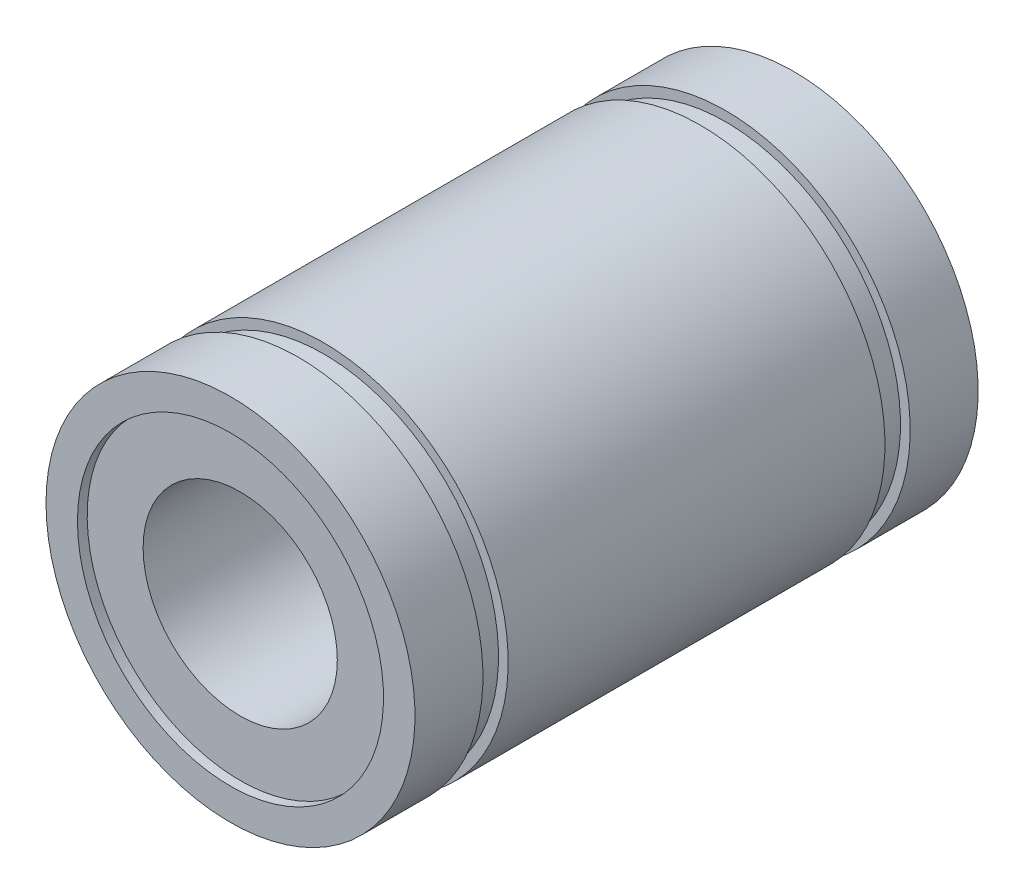
ISO-10303-21;
HEADER;
FILE_DESCRIPTION(('STEP AP214'),'2;1');
FILE_NAME('part.step','',(''),(''),'','','');
FILE_SCHEMA(('AUTOMOTIVE_DESIGN { 1 0 10303 214 1 1 1 1 }'));
ENDSEC;
DATA;
#1=APPLICATION_CONTEXT('core data for automotive mechanical design processes');
#2=APPLICATION_PROTOCOL_DEFINITION('international standard','automotive_design',2000,#1);
#3=PRODUCT_CONTEXT('',#1,'mechanical');
#4=PRODUCT('Part','Part','',(#3));
#5=PRODUCT_RELATED_PRODUCT_CATEGORY('part','',(#4));
#6=PRODUCT_DEFINITION_FORMATION('','',#4);
#7=PRODUCT_DEFINITION_CONTEXT('part definition',#1,'design');
#8=PRODUCT_DEFINITION('design','',#6,#7);
#9=PRODUCT_DEFINITION_SHAPE('','',#8);
#10=(LENGTH_UNIT() NAMED_UNIT(*) SI_UNIT(.MILLI.,.METRE.));
#11=(NAMED_UNIT(*) PLANE_ANGLE_UNIT() SI_UNIT($,.RADIAN.));
#12=(NAMED_UNIT(*) SI_UNIT($,.STERADIAN.) SOLID_ANGLE_UNIT());
#13=UNCERTAINTY_MEASURE_WITH_UNIT(LENGTH_MEASURE(1.E-05),#10,'distance_accuracy_value','');
#14=(GEOMETRIC_REPRESENTATION_CONTEXT(3) GLOBAL_UNCERTAINTY_ASSIGNED_CONTEXT((#13)) GLOBAL_UNIT_ASSIGNED_CONTEXT((#10,
#11,#12)) REPRESENTATION_CONTEXT('',''));
#15=CARTESIAN_POINT('',(0.,0.,0.));
#16=DIRECTION('',(0.,0.,1.));
#17=DIRECTION('',(1.,0.,0.));
#18=AXIS2_PLACEMENT_3D('',#15,#16,#17);
#19=CARTESIAN_POINT('',(0.,0.,29.));
#20=DIRECTION('',(0.,0.,-1.));
#21=DIRECTION('',(-1.,0.,0.));
#22=AXIS2_PLACEMENT_3D('',#19,#20,#21);
#23=PLANE('',#22);
#24=CARTESIAN_POINT('',(0.,0.,29.));
#25=DIRECTION('',(0.,0.,-1.));
#26=DIRECTION('',(-1.,0.,0.));
#27=AXIS2_PLACEMENT_3D('',#24,#25,#26);
#28=CIRCLE('',#27,7.88);
#29=CARTESIAN_POINT('',(-7.88,0.,29.));
#30=VERTEX_POINT('',#29);
#31=EDGE_CURVE('E17',#30,#30,#28,.T.);
#32=ORIENTED_EDGE('',*,*,#31,.T.);
#33=EDGE_LOOP('',(#32));
#34=FACE_BOUND('',#33,.T.);
#35=CARTESIAN_POINT('',(0.,0.,29.));
#36=DIRECTION('',(0.,0.,-1.));
#37=DIRECTION('',(-1.,0.,0.));
#38=AXIS2_PLACEMENT_3D('',#35,#36,#37);
#39=CIRCLE('',#38,9.5);
#40=CARTESIAN_POINT('',(-9.5,0.,29.));
#41=VERTEX_POINT('',#40);
#42=EDGE_CURVE('E10',#41,#41,#39,.T.);
#43=ORIENTED_EDGE('',*,*,#42,.F.);
#44=EDGE_LOOP('',(#43));
#45=FACE_BOUND('',#44,.T.);
#46=ADVANCED_FACE('F14',(#34,#45),#23,.F.);
#47=CARTESIAN_POINT('',(0.,0.,0.));
#48=DIRECTION('',(0.,0.,-1.));
#49=DIRECTION('',(-1.,0.,0.));
#50=AXIS2_PLACEMENT_3D('',#47,#48,#49);
#51=CYLINDRICAL_SURFACE('',#50,9.5);
#52=ORIENTED_EDGE('',*,*,#42,.T.);
#53=EDGE_LOOP('',(#52));
#54=FACE_BOUND('',#53,.T.);
#55=CARTESIAN_POINT('',(0.,0.,25.5));
#56=DIRECTION('',(0.,0.,-1.));
#57=DIRECTION('',(-1.,0.,0.));
#58=AXIS2_PLACEMENT_3D('',#55,#56,#57);
#59=CIRCLE('',#58,9.5);
#60=CARTESIAN_POINT('',(-9.5,0.,25.5));
#61=VERTEX_POINT('',#60);
#62=EDGE_CURVE('E22',#61,#61,#59,.T.);
#63=ORIENTED_EDGE('',*,*,#62,.F.);
#64=EDGE_LOOP('',(#63));
#65=FACE_BOUND('',#64,.T.);
#66=ADVANCED_FACE('F98',(#54,#65),#51,.T.);
#67=CARTESIAN_POINT('',(0.,9.,25.5));
#68=DIRECTION('',(0.,0.,-1.));
#69=DIRECTION('',(-1.,0.,0.));
#70=AXIS2_PLACEMENT_3D('',#67,#68,#69);
#71=PLANE('',#70);
#72=ORIENTED_EDGE('',*,*,#62,.T.);
#73=EDGE_LOOP('',(#72));
#74=FACE_BOUND('',#73,.T.);
#75=CARTESIAN_POINT('',(0.,0.,25.5));
#76=DIRECTION('',(0.,0.,-1.));
#77=DIRECTION('',(-1.,0.,0.));
#78=AXIS2_PLACEMENT_3D('',#75,#76,#77);
#79=CIRCLE('',#78,9.);
#80=CARTESIAN_POINT('',(-9.,0.,25.5));
#81=VERTEX_POINT('',#80);
#82=EDGE_CURVE('E32',#81,#81,#79,.T.);
#83=ORIENTED_EDGE('',*,*,#82,.F.);
#84=EDGE_LOOP('',(#83));
#85=FACE_BOUND('',#84,.T.);
#86=ADVANCED_FACE('F96',(#74,#85),#71,.T.);
#87=CARTESIAN_POINT('',(0.,0.,0.));
#88=DIRECTION('',(0.,0.,-1.));
#89=DIRECTION('',(-1.,0.,0.));
#90=AXIS2_PLACEMENT_3D('',#87,#88,#89);
#91=CYLINDRICAL_SURFACE('',#90,9.);
#92=ORIENTED_EDGE('',*,*,#82,.T.);
#93=EDGE_LOOP('',(#92));
#94=FACE_BOUND('',#93,.T.);
#95=CARTESIAN_POINT('',(0.,0.,24.2));
#96=DIRECTION('',(0.,0.,-1.));
#97=DIRECTION('',(-1.,0.,0.));
#98=AXIS2_PLACEMENT_3D('',#95,#96,#97);
#99=CIRCLE('',#98,9.);
#100=CARTESIAN_POINT('',(-9.,0.,24.2));
#101=VERTEX_POINT('',#100);
#102=EDGE_CURVE('E83',#101,#101,#99,.T.);
#103=ORIENTED_EDGE('',*,*,#102,.F.);
#104=EDGE_LOOP('',(#103));
#105=FACE_BOUND('',#104,.T.);
#106=ADVANCED_FACE('F93',(#94,#105),#91,.T.);
#107=CARTESIAN_POINT('',(0.,9.5,24.2));
#108=DIRECTION('',(0.,0.,1.));
#109=DIRECTION('',(1.,0.,0.));
#110=AXIS2_PLACEMENT_3D('',#107,#108,#109);
#111=PLANE('',#110);
#112=ORIENTED_EDGE('',*,*,#102,.T.);
#113=EDGE_LOOP('',(#112));
#114=FACE_BOUND('',#113,.T.);
#115=CARTESIAN_POINT('',(0.,0.,24.2));
#116=DIRECTION('',(0.,0.,-1.));
#117=DIRECTION('',(-1.,0.,0.));
#118=AXIS2_PLACEMENT_3D('',#115,#116,#117);
#119=CIRCLE('',#118,9.5);
#120=CARTESIAN_POINT('',(-9.5,0.,24.2));
#121=VERTEX_POINT('',#120);
#122=EDGE_CURVE('E79',#121,#121,#119,.T.);
#123=ORIENTED_EDGE('',*,*,#122,.F.);
#124=EDGE_LOOP('',(#123));
#125=FACE_BOUND('',#124,.T.);
#126=ADVANCED_FACE('F107',(#114,#125),#111,.T.);
#127=CARTESIAN_POINT('',(0.,0.,0.));
#128=DIRECTION('',(0.,0.,-1.));
#129=DIRECTION('',(-1.,0.,0.));
#130=AXIS2_PLACEMENT_3D('',#127,#128,#129);
#131=CYLINDRICAL_SURFACE('',#130,9.5);
#132=ORIENTED_EDGE('',*,*,#122,.T.);
#133=EDGE_LOOP('',(#132));
#134=FACE_BOUND('',#133,.T.);
#135=CARTESIAN_POINT('',(0.,0.,4.8));
#136=DIRECTION('',(0.,0.,-1.));
#137=DIRECTION('',(-1.,0.,0.));
#138=AXIS2_PLACEMENT_3D('',#135,#136,#137);
#139=CIRCLE('',#138,9.5);
#140=CARTESIAN_POINT('',(-9.5,0.,4.8));
#141=VERTEX_POINT('',#140);
#142=EDGE_CURVE('E75',#141,#141,#139,.T.);
#143=ORIENTED_EDGE('',*,*,#142,.F.);
#144=EDGE_LOOP('',(#143));
#145=FACE_BOUND('',#144,.T.);
#146=ADVANCED_FACE('F156',(#134,#145),#131,.T.);
#147=CARTESIAN_POINT('',(0.,9.,4.8));
#148=DIRECTION('',(0.,0.,-1.));
#149=DIRECTION('',(-1.,0.,0.));
#150=AXIS2_PLACEMENT_3D('',#147,#148,#149);
#151=PLANE('',#150);
#152=ORIENTED_EDGE('',*,*,#142,.T.);
#153=EDGE_LOOP('',(#152));
#154=FACE_BOUND('',#153,.T.);
#155=CARTESIAN_POINT('',(0.,0.,4.8));
#156=DIRECTION('',(0.,0.,-1.));
#157=DIRECTION('',(-1.,0.,0.));
#158=AXIS2_PLACEMENT_3D('',#155,#156,#157);
#159=CIRCLE('',#158,9.);
#160=CARTESIAN_POINT('',(-9.,0.,4.8));
#161=VERTEX_POINT('',#160);
#162=EDGE_CURVE('E71',#161,#161,#159,.T.);
#163=ORIENTED_EDGE('',*,*,#162,.F.);
#164=EDGE_LOOP('',(#163));
#165=FACE_BOUND('',#164,.T.);
#166=ADVANCED_FACE('F152',(#154,#165),#151,.T.);
#167=CARTESIAN_POINT('',(0.,0.,0.));
#168=DIRECTION('',(0.,0.,-1.));
#169=DIRECTION('',(-1.,0.,0.));
#170=AXIS2_PLACEMENT_3D('',#167,#168,#169);
#171=CYLINDRICAL_SURFACE('',#170,9.);
#172=ORIENTED_EDGE('',*,*,#162,.T.);
#173=EDGE_LOOP('',(#172));
#174=FACE_BOUND('',#173,.T.);
#175=CARTESIAN_POINT('',(0.,0.,3.5));
#176=DIRECTION('',(0.,0.,-1.));
#177=DIRECTION('',(-1.,0.,0.));
#178=AXIS2_PLACEMENT_3D('',#175,#176,#177);
#179=CIRCLE('',#178,9.);
#180=CARTESIAN_POINT('',(-9.,0.,3.5));
#181=VERTEX_POINT('',#180);
#182=EDGE_CURVE('E67',#181,#181,#179,.T.);
#183=ORIENTED_EDGE('',*,*,#182,.F.);
#184=EDGE_LOOP('',(#183));
#185=FACE_BOUND('',#184,.T.);
#186=ADVANCED_FACE('F148',(#174,#185),#171,.T.);
#187=CARTESIAN_POINT('',(0.,9.5,3.5));
#188=DIRECTION('',(0.,0.,1.));
#189=DIRECTION('',(1.,0.,0.));
#190=AXIS2_PLACEMENT_3D('',#187,#188,#189);
#191=PLANE('',#190);
#192=ORIENTED_EDGE('',*,*,#182,.T.);
#193=EDGE_LOOP('',(#192));
#194=FACE_BOUND('',#193,.T.);
#195=CARTESIAN_POINT('',(0.,0.,3.5));
#196=DIRECTION('',(0.,0.,-1.));
#197=DIRECTION('',(-1.,0.,0.));
#198=AXIS2_PLACEMENT_3D('',#195,#196,#197);
#199=CIRCLE('',#198,9.5);
#200=CARTESIAN_POINT('',(-9.5,0.,3.5));
#201=VERTEX_POINT('',#200);
#202=EDGE_CURVE('E63',#201,#201,#199,.T.);
#203=ORIENTED_EDGE('',*,*,#202,.F.);
#204=EDGE_LOOP('',(#203));
#205=FACE_BOUND('',#204,.T.);
#206=ADVANCED_FACE('F144',(#194,#205),#191,.T.);
#207=CARTESIAN_POINT('',(0.,0.,0.));
#208=DIRECTION('',(0.,0.,-1.));
#209=DIRECTION('',(-1.,0.,0.));
#210=AXIS2_PLACEMENT_3D('',#207,#208,#209);
#211=CYLINDRICAL_SURFACE('',#210,9.5);
#212=ORIENTED_EDGE('',*,*,#202,.T.);
#213=EDGE_LOOP('',(#212));
#214=FACE_BOUND('',#213,.T.);
#215=CARTESIAN_POINT('',(0.,0.,0.));
#216=DIRECTION('',(0.,0.,-1.));
#217=DIRECTION('',(-1.,0.,0.));
#218=AXIS2_PLACEMENT_3D('',#215,#216,#217);
#219=CIRCLE('',#218,9.5);
#220=CARTESIAN_POINT('',(-9.5,0.,0.));
#221=VERTEX_POINT('',#220);
#222=EDGE_CURVE('E45',#221,#221,#219,.T.);
#223=ORIENTED_EDGE('',*,*,#222,.F.);
#224=EDGE_LOOP('',(#223));
#225=FACE_BOUND('',#224,.T.);
#226=ADVANCED_FACE('F129',(#214,#225),#211,.T.);
#227=CARTESIAN_POINT('',(0.,0.,0.));
#228=DIRECTION('',(0.,0.,-1.));
#229=DIRECTION('',(-1.,0.,0.));
#230=AXIS2_PLACEMENT_3D('',#227,#228,#229);
#231=PLANE('',#230);
#232=CARTESIAN_POINT('',(0.,0.,0.));
#233=DIRECTION('',(0.,0.,-1.));
#234=DIRECTION('',(-1.,0.,0.));
#235=AXIS2_PLACEMENT_3D('',#232,#233,#234);
#236=CIRCLE('',#235,7.88);
#237=CARTESIAN_POINT('',(-7.88,0.,0.));
#238=VERTEX_POINT('',#237);
#239=EDGE_CURVE('E35',#238,#238,#236,.T.);
#240=ORIENTED_EDGE('',*,*,#239,.F.);
#241=EDGE_LOOP('',(#240));
#242=FACE_BOUND('',#241,.T.);
#243=ORIENTED_EDGE('',*,*,#222,.T.);
#244=EDGE_LOOP('',(#243));
#245=FACE_BOUND('',#244,.T.);
#246=ADVANCED_FACE('F119',(#242,#245),#231,.T.);
#247=CARTESIAN_POINT('',(0.,0.,30.));
#248=DIRECTION('',(0.,0.,-1.));
#249=DIRECTION('',(0.,1.,0.));
#250=AXIS2_PLACEMENT_3D('',#247,#248,#249);
#251=CYLINDRICAL_SURFACE('',#250,7.88);
#252=CARTESIAN_POINT('',(0.,0.,28.5));
#253=DIRECTION('',(0.,0.,1.));
#254=DIRECTION('',(0.,1.,0.));
#255=AXIS2_PLACEMENT_3D('',#252,#253,#254);
#256=CIRCLE('',#255,7.88);
#257=CARTESIAN_POINT('',(0.,7.88,28.5));
#258=VERTEX_POINT('',#257);
#259=EDGE_CURVE('E266',#258,#258,#256,.T.);
#260=ORIENTED_EDGE('',*,*,#259,.F.);
#261=EDGE_LOOP('',(#260));
#262=FACE_BOUND('',#261,.T.);
#263=ORIENTED_EDGE('',*,*,#31,.F.);
#264=EDGE_LOOP('',(#263));
#265=FACE_BOUND('',#264,.T.);
#266=ADVANCED_FACE('F116',(#262,#265),#251,.F.);
#267=CARTESIAN_POINT('',(0.,0.,-1.));
#268=DIRECTION('',(0.,0.,1.));
#269=DIRECTION('',(0.,-1.,0.));
#270=AXIS2_PLACEMENT_3D('',#267,#268,#269);
#271=CYLINDRICAL_SURFACE('',#270,5.);
#272=CARTESIAN_POINT('',(0.,0.,28.5));
#273=DIRECTION('',(0.,0.,-1.));
#274=DIRECTION('',(-1.,0.,0.));
#275=AXIS2_PLACEMENT_3D('',#272,#273,#274);
#276=CIRCLE('',#275,5.);
#277=CARTESIAN_POINT('',(-5.,0.,28.5));
#278=VERTEX_POINT('',#277);
#279=EDGE_CURVE('E38',#278,#278,#276,.F.);
#280=ORIENTED_EDGE('',*,*,#279,.T.);
#281=EDGE_LOOP('',(#280));
#282=FACE_BOUND('',#281,.T.);
#283=CARTESIAN_POINT('',(0.,0.,0.5));
#284=DIRECTION('',(0.,0.,1.));
#285=DIRECTION('',(1.,0.,0.));
#286=AXIS2_PLACEMENT_3D('',#283,#284,#285);
#287=CIRCLE('',#286,5.);
#288=CARTESIAN_POINT('',(5.,0.,0.5));
#289=VERTEX_POINT('',#288);
#290=EDGE_CURVE('E48',#289,#289,#287,.F.);
#291=ORIENTED_EDGE('',*,*,#290,.T.);
#292=EDGE_LOOP('',(#291));
#293=FACE_BOUND('',#292,.T.);
#294=ADVANCED_FACE('F118',(#282,#293),#271,.F.);
#295=CARTESIAN_POINT('',(0.,0.,0.5));
#296=DIRECTION('',(0.,0.,1.));
#297=DIRECTION('',(1.,0.,0.));
#298=AXIS2_PLACEMENT_3D('',#295,#296,#297);
#299=PLANE('',#298);
#300=ORIENTED_EDGE('',*,*,#290,.F.);
#301=EDGE_LOOP('',(#300));
#302=FACE_BOUND('',#301,.T.);
#303=CARTESIAN_POINT('',(0.,0.,0.5));
#304=DIRECTION('',(0.,0.,-1.));
#305=DIRECTION('',(0.,-1.,0.));
#306=AXIS2_PLACEMENT_3D('',#303,#304,#305);
#307=CIRCLE('',#306,7.88);
#308=CARTESIAN_POINT('',(0.,-7.88,0.5));
#309=VERTEX_POINT('',#308);
#310=EDGE_CURVE('E56',#309,#309,#307,.T.);
#311=ORIENTED_EDGE('',*,*,#310,.T.);
#312=EDGE_LOOP('',(#311));
#313=FACE_BOUND('',#312,.T.);
#314=ADVANCED_FACE('F127',(#302,#313),#299,.F.);
#315=CARTESIAN_POINT('',(0.,0.,-1.));
#316=DIRECTION('',(0.,0.,1.));
#317=DIRECTION('',(0.,-1.,0.));
#318=AXIS2_PLACEMENT_3D('',#315,#316,#317);
#319=CYLINDRICAL_SURFACE('',#318,7.88);
#320=ORIENTED_EDGE('',*,*,#239,.T.);
#321=EDGE_LOOP('',(#320));
#322=FACE_BOUND('',#321,.T.);
#323=ORIENTED_EDGE('',*,*,#310,.F.);
#324=EDGE_LOOP('',(#323));
#325=FACE_BOUND('',#324,.T.);
#326=ADVANCED_FACE('F138',(#322,#325),#319,.F.);
#327=CARTESIAN_POINT('',(0.,0.,28.5));
#328=DIRECTION('',(0.,0.,-1.));
#329=DIRECTION('',(-1.,0.,0.));
#330=AXIS2_PLACEMENT_3D('',#327,#328,#329);
#331=PLANE('',#330);
#332=ORIENTED_EDGE('',*,*,#279,.F.);
#333=EDGE_LOOP('',(#332));
#334=FACE_BOUND('',#333,.T.);
#335=ORIENTED_EDGE('',*,*,#259,.T.);
#336=EDGE_LOOP('',(#335));
#337=FACE_BOUND('',#336,.T.);
#338=ADVANCED_FACE('F135',(#334,#337),#331,.F.);
#339=CLOSED_SHELL('',(#46,#66,#86,#106,#126,#146,#166,#186,#206,#226,#246,#266,#294,#314,#326,#338));
#340=MANIFOLD_SOLID_BREP('B1',#339);
#341=ADVANCED_BREP_SHAPE_REPRESENTATION('',(#18,#340),#14);
#342=SHAPE_DEFINITION_REPRESENTATION(#9,#341);
ENDSEC;
END-ISO-10303-21;
